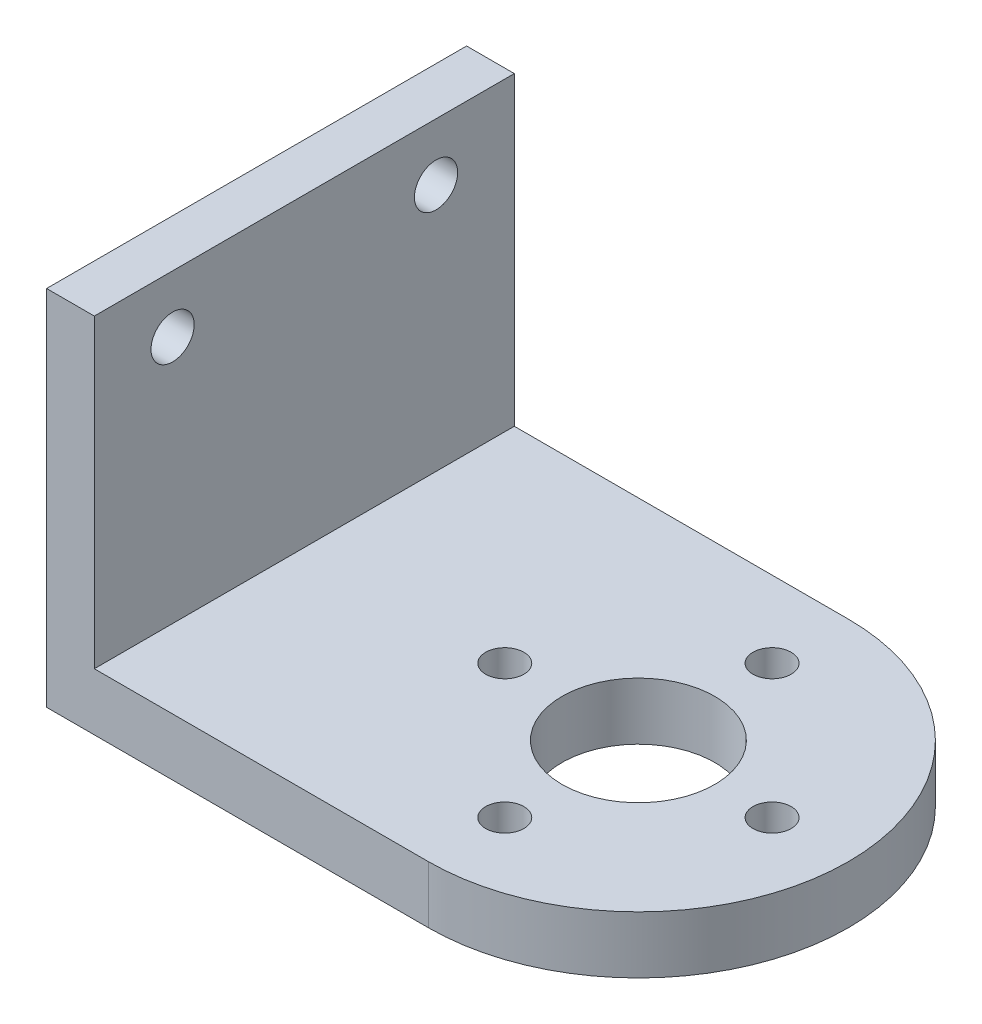
ISO-10303-21;
HEADER;
FILE_DESCRIPTION(('STEP AP214'),'2;1');
FILE_NAME('part.step','',(''),(''),'','','');
FILE_SCHEMA(('AUTOMOTIVE_DESIGN { 1 0 10303 214 1 1 1 1 }'));
ENDSEC;
DATA;
#1=APPLICATION_CONTEXT('core data for automotive mechanical design processes');
#2=APPLICATION_PROTOCOL_DEFINITION('international standard','automotive_design',2000,#1);
#3=PRODUCT_CONTEXT('',#1,'mechanical');
#4=PRODUCT('Part','Part','',(#3));
#5=PRODUCT_RELATED_PRODUCT_CATEGORY('part','',(#4));
#6=PRODUCT_DEFINITION_FORMATION('','',#4);
#7=PRODUCT_DEFINITION_CONTEXT('part definition',#1,'design');
#8=PRODUCT_DEFINITION('design','',#6,#7);
#9=PRODUCT_DEFINITION_SHAPE('','',#8);
#10=(LENGTH_UNIT() NAMED_UNIT(*) SI_UNIT(.MILLI.,.METRE.));
#11=(NAMED_UNIT(*) PLANE_ANGLE_UNIT() SI_UNIT($,.RADIAN.));
#12=(NAMED_UNIT(*) SI_UNIT($,.STERADIAN.) SOLID_ANGLE_UNIT());
#13=UNCERTAINTY_MEASURE_WITH_UNIT(LENGTH_MEASURE(1.E-05),#10,'distance_accuracy_value','');
#14=(GEOMETRIC_REPRESENTATION_CONTEXT(3) GLOBAL_UNCERTAINTY_ASSIGNED_CONTEXT((#13)) GLOBAL_UNIT_ASSIGNED_CONTEXT((#10,
#11,#12)) REPRESENTATION_CONTEXT('',''));
#15=CARTESIAN_POINT('',(0.,0.,0.));
#16=DIRECTION('',(0.,0.,1.));
#17=DIRECTION('',(1.,0.,0.));
#18=AXIS2_PLACEMENT_3D('',#15,#16,#17);
#19=CARTESIAN_POINT('',(6.,3.,0.));
#20=DIRECTION('',(0.,1.,0.));
#21=DIRECTION('',(0.,0.,1.));
#22=AXIS2_PLACEMENT_3D('',#19,#20,#21);
#23=PLANE('',#22);
#24=DIRECTION('',(0.,0.,-1.));
#25=VECTOR('',#24,1.);
#26=CARTESIAN_POINT('',(-11.5,3.,-11.));
#27=LINE('',#26,#25);
#28=CARTESIAN_POINT('',(-11.5,3.,11.));
#29=VERTEX_POINT('',#28);
#30=CARTESIAN_POINT('',(-11.5,3.,-11.));
#31=VERTEX_POINT('',#30);
#32=EDGE_CURVE('E50',#29,#31,#27,.T.);
#33=ORIENTED_EDGE('',*,*,#32,.F.);
#34=DIRECTION('',(1.,0.,0.));
#35=VECTOR('',#34,1.);
#36=CARTESIAN_POINT('',(6.,3.,11.));
#37=LINE('',#36,#35);
#38=CARTESIAN_POINT('',(6.,3.,11.));
#39=VERTEX_POINT('',#38);
#40=EDGE_CURVE('E88',#29,#39,#37,.T.);
#41=ORIENTED_EDGE('',*,*,#40,.T.);
#42=CARTESIAN_POINT('',(6.,3.,0.));
#43=DIRECTION('',(0.,1.,0.));
#44=DIRECTION('',(0.,0.,1.));
#45=AXIS2_PLACEMENT_3D('',#42,#43,#44);
#46=CIRCLE('',#45,11.);
#47=CARTESIAN_POINT('',(6.,3.,-11.));
#48=VERTEX_POINT('',#47);
#49=EDGE_CURVE('E56',#39,#48,#46,.T.);
#50=ORIENTED_EDGE('',*,*,#49,.T.);
#51=DIRECTION('',(-1.,0.,0.));
#52=VECTOR('',#51,1.);
#53=CARTESIAN_POINT('',(-14.,3.,-11.));
#54=LINE('',#53,#52);
#55=EDGE_CURVE('E99',#48,#31,#54,.T.);
#56=ORIENTED_EDGE('',*,*,#55,.T.);
#57=EDGE_LOOP('',(#33,#41,#50,#56));
#58=FACE_BOUND('',#57,.T.);
#59=CARTESIAN_POINT('',(-1.,3.,0.));
#60=DIRECTION('',(0.,1.,0.));
#61=DIRECTION('',(0.,0.,1.));
#62=AXIS2_PLACEMENT_3D('',#59,#60,#61);
#63=CIRCLE('',#62,1.);
#64=CARTESIAN_POINT('',(-1.,3.,0.999999999999951));
#65=VERTEX_POINT('',#64);
#66=EDGE_CURVE('E145',#65,#65,#63,.T.);
#67=ORIENTED_EDGE('',*,*,#66,.F.);
#68=EDGE_LOOP('',(#67));
#69=FACE_BOUND('',#68,.T.);
#70=CARTESIAN_POINT('',(6.,3.,0.));
#71=DIRECTION('',(0.,1.,0.));
#72=DIRECTION('',(0.,0.,1.));
#73=AXIS2_PLACEMENT_3D('',#70,#71,#72);
#74=CIRCLE('',#73,4.);
#75=CARTESIAN_POINT('',(6.,3.,4.));
#76=VERTEX_POINT('',#75);
#77=EDGE_CURVE('E157',#76,#76,#74,.T.);
#78=ORIENTED_EDGE('',*,*,#77,.F.);
#79=EDGE_LOOP('',(#78));
#80=FACE_BOUND('',#79,.T.);
#81=CARTESIAN_POINT('',(13.,3.,0.));
#82=DIRECTION('',(0.,1.,0.));
#83=DIRECTION('',(0.,0.,1.));
#84=AXIS2_PLACEMENT_3D('',#81,#82,#83);
#85=CIRCLE('',#84,1.);
#86=CARTESIAN_POINT('',(13.,3.,1.));
#87=VERTEX_POINT('',#86);
#88=EDGE_CURVE('E104',#87,#87,#85,.T.);
#89=ORIENTED_EDGE('',*,*,#88,.F.);
#90=EDGE_LOOP('',(#89));
#91=FACE_BOUND('',#90,.T.);
#92=CARTESIAN_POINT('',(5.99999999999998,3.,7.));
#93=DIRECTION('',(0.,1.,0.));
#94=DIRECTION('',(0.,0.,1.));
#95=AXIS2_PLACEMENT_3D('',#92,#93,#94);
#96=CIRCLE('',#95,1.);
#97=CARTESIAN_POINT('',(5.99999999999998,3.,8.));
#98=VERTEX_POINT('',#97);
#99=EDGE_CURVE('E151',#98,#98,#96,.T.);
#100=ORIENTED_EDGE('',*,*,#99,.F.);
#101=EDGE_LOOP('',(#100));
#102=FACE_BOUND('',#101,.T.);
#103=CARTESIAN_POINT('',(6.00000000000008,3.,-7.));
#104=DIRECTION('',(0.,1.,0.));
#105=DIRECTION('',(0.,0.,1.));
#106=AXIS2_PLACEMENT_3D('',#103,#104,#105);
#107=CIRCLE('',#106,1.);
#108=CARTESIAN_POINT('',(6.00000000000008,3.,-6.));
#109=VERTEX_POINT('',#108);
#110=EDGE_CURVE('E136',#109,#109,#107,.T.);
#111=ORIENTED_EDGE('',*,*,#110,.F.);
#112=EDGE_LOOP('',(#111));
#113=FACE_BOUND('',#112,.T.);
#114=ADVANCED_FACE('F35',(#58,#69,#80,#91,#102,#113),#23,.T.);
#115=CARTESIAN_POINT('',(6.,0.,0.));
#116=DIRECTION('',(0.,1.,0.));
#117=DIRECTION('',(0.,0.,1.));
#118=AXIS2_PLACEMENT_3D('',#115,#116,#117);
#119=PLANE('',#118);
#120=DIRECTION('',(1.,0.,0.));
#121=VECTOR('',#120,1.);
#122=CARTESIAN_POINT('',(6.,0.,11.));
#123=LINE('',#122,#121);
#124=CARTESIAN_POINT('',(-14.,0.,11.));
#125=VERTEX_POINT('',#124);
#126=CARTESIAN_POINT('',(6.,0.,11.));
#127=VERTEX_POINT('',#126);
#128=EDGE_CURVE('E94',#125,#127,#123,.T.);
#129=ORIENTED_EDGE('',*,*,#128,.F.);
#130=DIRECTION('',(0.,0.,1.));
#131=VECTOR('',#130,1.);
#132=CARTESIAN_POINT('',(-14.,0.,11.));
#133=LINE('',#132,#131);
#134=CARTESIAN_POINT('',(-14.,0.,-11.));
#135=VERTEX_POINT('',#134);
#136=EDGE_CURVE('E76',#135,#125,#133,.T.);
#137=ORIENTED_EDGE('',*,*,#136,.F.);
#138=DIRECTION('',(-1.,0.,0.));
#139=VECTOR('',#138,1.);
#140=CARTESIAN_POINT('',(-14.,0.,-11.));
#141=LINE('',#140,#139);
#142=CARTESIAN_POINT('',(6.,0.,-11.));
#143=VERTEX_POINT('',#142);
#144=EDGE_CURVE('E89',#143,#135,#141,.T.);
#145=ORIENTED_EDGE('',*,*,#144,.F.);
#146=CARTESIAN_POINT('',(6.,0.,0.));
#147=DIRECTION('',(0.,1.,0.));
#148=DIRECTION('',(0.,0.,1.));
#149=AXIS2_PLACEMENT_3D('',#146,#147,#148);
#150=CIRCLE('',#149,11.);
#151=EDGE_CURVE('E103',#127,#143,#150,.T.);
#152=ORIENTED_EDGE('',*,*,#151,.F.);
#153=EDGE_LOOP('',(#129,#137,#145,#152));
#154=FACE_BOUND('',#153,.T.);
#155=CARTESIAN_POINT('',(13.,0.,0.));
#156=DIRECTION('',(0.,1.,0.));
#157=DIRECTION('',(0.,0.,1.));
#158=AXIS2_PLACEMENT_3D('',#155,#156,#157);
#159=CIRCLE('',#158,1.);
#160=CARTESIAN_POINT('',(13.,0.,1.));
#161=VERTEX_POINT('',#160);
#162=EDGE_CURVE('E108',#161,#161,#159,.T.);
#163=ORIENTED_EDGE('',*,*,#162,.T.);
#164=EDGE_LOOP('',(#163));
#165=FACE_BOUND('',#164,.T.);
#166=CARTESIAN_POINT('',(6.,0.,0.));
#167=DIRECTION('',(0.,1.,0.));
#168=DIRECTION('',(0.,0.,1.));
#169=AXIS2_PLACEMENT_3D('',#166,#167,#168);
#170=CIRCLE('',#169,4.);
#171=CARTESIAN_POINT('',(6.,0.,4.));
#172=VERTEX_POINT('',#171);
#173=EDGE_CURVE('E154',#172,#172,#170,.T.);
#174=ORIENTED_EDGE('',*,*,#173,.T.);
#175=EDGE_LOOP('',(#174));
#176=FACE_BOUND('',#175,.T.);
#177=CARTESIAN_POINT('',(5.99999999999998,0.,7.));
#178=DIRECTION('',(0.,1.,0.));
#179=DIRECTION('',(0.,0.,1.));
#180=AXIS2_PLACEMENT_3D('',#177,#178,#179);
#181=CIRCLE('',#180,1.);
#182=CARTESIAN_POINT('',(5.99999999999998,0.,8.));
#183=VERTEX_POINT('',#182);
#184=EDGE_CURVE('E148',#183,#183,#181,.T.);
#185=ORIENTED_EDGE('',*,*,#184,.T.);
#186=EDGE_LOOP('',(#185));
#187=FACE_BOUND('',#186,.T.);
#188=CARTESIAN_POINT('',(-1.,0.,0.));
#189=DIRECTION('',(0.,1.,0.));
#190=DIRECTION('',(0.,0.,1.));
#191=AXIS2_PLACEMENT_3D('',#188,#189,#190);
#192=CIRCLE('',#191,1.);
#193=CARTESIAN_POINT('',(-1.,0.,0.999999999999951));
#194=VERTEX_POINT('',#193);
#195=EDGE_CURVE('E143',#194,#194,#192,.T.);
#196=ORIENTED_EDGE('',*,*,#195,.T.);
#197=EDGE_LOOP('',(#196));
#198=FACE_BOUND('',#197,.T.);
#199=CARTESIAN_POINT('',(6.00000000000008,0.,-7.));
#200=DIRECTION('',(0.,1.,0.));
#201=DIRECTION('',(0.,0.,1.));
#202=AXIS2_PLACEMENT_3D('',#199,#200,#201);
#203=CIRCLE('',#202,1.);
#204=CARTESIAN_POINT('',(6.00000000000008,0.,-6.));
#205=VERTEX_POINT('',#204);
#206=EDGE_CURVE('E132',#205,#205,#203,.T.);
#207=ORIENTED_EDGE('',*,*,#206,.T.);
#208=EDGE_LOOP('',(#207));
#209=FACE_BOUND('',#208,.T.);
#210=ADVANCED_FACE('F101',(#154,#165,#176,#187,#198,#209),#119,.F.);
#211=CARTESIAN_POINT('',(6.,3.,11.));
#212=DIRECTION('',(0.,0.,-1.));
#213=DIRECTION('',(-1.,0.,0.));
#214=AXIS2_PLACEMENT_3D('',#211,#212,#213);
#215=PLANE('',#214);
#216=ORIENTED_EDGE('',*,*,#128,.T.);
#217=DIRECTION('',(0.,-1.,0.));
#218=VECTOR('',#217,1.);
#219=CARTESIAN_POINT('',(6.,3.,11.));
#220=LINE('',#219,#218);
#221=EDGE_CURVE('E11',#39,#127,#220,.T.);
#222=ORIENTED_EDGE('',*,*,#221,.F.);
#223=ORIENTED_EDGE('',*,*,#40,.F.);
#224=DIRECTION('',(0.,-1.,0.));
#225=VECTOR('',#224,1.);
#226=CARTESIAN_POINT('',(-11.5,19.,11.));
#227=LINE('',#226,#225);
#228=CARTESIAN_POINT('',(-11.5,19.,11.));
#229=VERTEX_POINT('',#228);
#230=EDGE_CURVE('E123',#229,#29,#227,.T.);
#231=ORIENTED_EDGE('',*,*,#230,.F.);
#232=DIRECTION('',(1.,0.,0.));
#233=VECTOR('',#232,1.);
#234=CARTESIAN_POINT('',(-11.5,19.,11.));
#235=LINE('',#234,#233);
#236=CARTESIAN_POINT('',(-14.,19.,11.));
#237=VERTEX_POINT('',#236);
#238=EDGE_CURVE('E97',#237,#229,#235,.T.);
#239=ORIENTED_EDGE('',*,*,#238,.F.);
#240=DIRECTION('',(0.,-1.,0.));
#241=VECTOR('',#240,1.);
#242=CARTESIAN_POINT('',(-14.,3.,11.));
#243=LINE('',#242,#241);
#244=EDGE_CURVE('E81',#237,#125,#243,.T.);
#245=ORIENTED_EDGE('',*,*,#244,.T.);
#246=EDGE_LOOP('',(#216,#222,#223,#231,#239,#245));
#247=FACE_BOUND('',#246,.T.);
#248=ADVANCED_FACE('F37',(#247),#215,.F.);
#249=CARTESIAN_POINT('',(6.,3.,0.));
#250=DIRECTION('',(0.,-1.,0.));
#251=DIRECTION('',(0.,0.,-1.));
#252=AXIS2_PLACEMENT_3D('',#249,#250,#251);
#253=CYLINDRICAL_SURFACE('',#252,11.);
#254=ORIENTED_EDGE('',*,*,#151,.T.);
#255=DIRECTION('',(0.,-1.,0.));
#256=VECTOR('',#255,1.);
#257=CARTESIAN_POINT('',(6.,3.,-11.));
#258=LINE('',#257,#256);
#259=EDGE_CURVE('E43',#48,#143,#258,.T.);
#260=ORIENTED_EDGE('',*,*,#259,.F.);
#261=ORIENTED_EDGE('',*,*,#49,.F.);
#262=ORIENTED_EDGE('',*,*,#221,.T.);
#263=EDGE_LOOP('',(#254,#260,#261,#262));
#264=FACE_BOUND('',#263,.T.);
#265=ADVANCED_FACE('F120',(#264),#253,.T.);
#266=CARTESIAN_POINT('',(-14.,3.,-11.));
#267=DIRECTION('',(0.,0.,1.));
#268=DIRECTION('',(1.,0.,0.));
#269=AXIS2_PLACEMENT_3D('',#266,#267,#268);
#270=PLANE('',#269);
#271=ORIENTED_EDGE('',*,*,#144,.T.);
#272=DIRECTION('',(0.,-1.,0.));
#273=VECTOR('',#272,1.);
#274=CARTESIAN_POINT('',(-14.,3.,-11.));
#275=LINE('',#274,#273);
#276=CARTESIAN_POINT('',(-14.,19.,-11.));
#277=VERTEX_POINT('',#276);
#278=EDGE_CURVE('E84',#277,#135,#275,.T.);
#279=ORIENTED_EDGE('',*,*,#278,.F.);
#280=DIRECTION('',(-1.,0.,0.));
#281=VECTOR('',#280,1.);
#282=CARTESIAN_POINT('',(-14.,19.,-11.));
#283=LINE('',#282,#281);
#284=CARTESIAN_POINT('',(-11.5,19.,-11.));
#285=VERTEX_POINT('',#284);
#286=EDGE_CURVE('E138',#285,#277,#283,.T.);
#287=ORIENTED_EDGE('',*,*,#286,.F.);
#288=DIRECTION('',(0.,-1.,0.));
#289=VECTOR('',#288,1.);
#290=CARTESIAN_POINT('',(-11.5,19.,-11.));
#291=LINE('',#290,#289);
#292=EDGE_CURVE('E133',#285,#31,#291,.T.);
#293=ORIENTED_EDGE('',*,*,#292,.T.);
#294=ORIENTED_EDGE('',*,*,#55,.F.);
#295=ORIENTED_EDGE('',*,*,#259,.T.);
#296=EDGE_LOOP('',(#271,#279,#287,#293,#294,#295));
#297=FACE_BOUND('',#296,.T.);
#298=ADVANCED_FACE('F117',(#297),#270,.F.);
#299=CARTESIAN_POINT('',(-14.,3.,11.));
#300=DIRECTION('',(1.,0.,0.));
#301=DIRECTION('',(0.,0.,-1.));
#302=AXIS2_PLACEMENT_3D('',#299,#300,#301);
#303=PLANE('',#302);
#304=CARTESIAN_POINT('',(-14.,16.,6.9));
#305=DIRECTION('',(1.,0.,0.));
#306=DIRECTION('',(0.,0.,-1.));
#307=AXIS2_PLACEMENT_3D('',#304,#305,#306);
#308=CIRCLE('',#307,1.13097743795664);
#309=CARTESIAN_POINT('',(-14.,16.,5.76902256204336));
#310=VERTEX_POINT('',#309);
#311=EDGE_CURVE('E184',#310,#310,#308,.T.);
#312=ORIENTED_EDGE('',*,*,#311,.T.);
#313=EDGE_LOOP('',(#312));
#314=FACE_BOUND('',#313,.T.);
#315=CARTESIAN_POINT('',(-14.,16.,-6.9));
#316=DIRECTION('',(1.,0.,0.));
#317=DIRECTION('',(0.,0.,-1.));
#318=AXIS2_PLACEMENT_3D('',#315,#316,#317);
#319=CIRCLE('',#318,1.1323934249751);
#320=CARTESIAN_POINT('',(-14.,16.,-8.0323934249751));
#321=VERTEX_POINT('',#320);
#322=EDGE_CURVE('E178',#321,#321,#319,.T.);
#323=ORIENTED_EDGE('',*,*,#322,.T.);
#324=EDGE_LOOP('',(#323));
#325=FACE_BOUND('',#324,.T.);
#326=ORIENTED_EDGE('',*,*,#136,.T.);
#327=ORIENTED_EDGE('',*,*,#244,.F.);
#328=DIRECTION('',(0.,0.,1.));
#329=VECTOR('',#328,1.);
#330=CARTESIAN_POINT('',(-14.,19.,-11.));
#331=LINE('',#330,#329);
#332=EDGE_CURVE('E172',#277,#237,#331,.T.);
#333=ORIENTED_EDGE('',*,*,#332,.F.);
#334=ORIENTED_EDGE('',*,*,#278,.T.);
#335=EDGE_LOOP('',(#326,#327,#333,#334));
#336=FACE_BOUND('',#335,.T.);
#337=ADVANCED_FACE('F78',(#314,#325,#336),#303,.F.);
#338=CARTESIAN_POINT('',(13.,3.,0.));
#339=DIRECTION('',(0.,-1.,0.));
#340=DIRECTION('',(0.,0.,-1.));
#341=AXIS2_PLACEMENT_3D('',#338,#339,#340);
#342=CYLINDRICAL_SURFACE('',#341,1.);
#343=ORIENTED_EDGE('',*,*,#88,.T.);
#344=EDGE_LOOP('',(#343));
#345=FACE_BOUND('',#344,.T.);
#346=ORIENTED_EDGE('',*,*,#162,.F.);
#347=EDGE_LOOP('',(#346));
#348=FACE_BOUND('',#347,.T.);
#349=ADVANCED_FACE('F219',(#345,#348),#342,.F.);
#350=CARTESIAN_POINT('',(6.,3.,0.));
#351=DIRECTION('',(0.,-1.,0.));
#352=DIRECTION('',(0.,0.,-1.));
#353=AXIS2_PLACEMENT_3D('',#350,#351,#352);
#354=CYLINDRICAL_SURFACE('',#353,4.);
#355=ORIENTED_EDGE('',*,*,#77,.T.);
#356=EDGE_LOOP('',(#355));
#357=FACE_BOUND('',#356,.T.);
#358=ORIENTED_EDGE('',*,*,#173,.F.);
#359=EDGE_LOOP('',(#358));
#360=FACE_BOUND('',#359,.T.);
#361=ADVANCED_FACE('F253',(#357,#360),#354,.F.);
#362=CARTESIAN_POINT('',(5.99999999999998,3.,7.));
#363=DIRECTION('',(0.,-1.,0.));
#364=DIRECTION('',(0.,0.,-1.));
#365=AXIS2_PLACEMENT_3D('',#362,#363,#364);
#366=CYLINDRICAL_SURFACE('',#365,1.);
#367=ORIENTED_EDGE('',*,*,#99,.T.);
#368=EDGE_LOOP('',(#367));
#369=FACE_BOUND('',#368,.T.);
#370=ORIENTED_EDGE('',*,*,#184,.F.);
#371=EDGE_LOOP('',(#370));
#372=FACE_BOUND('',#371,.T.);
#373=ADVANCED_FACE('F263',(#369,#372),#366,.F.);
#374=CARTESIAN_POINT('',(-1.,3.,0.));
#375=DIRECTION('',(0.,-1.,0.));
#376=DIRECTION('',(0.,0.,-1.));
#377=AXIS2_PLACEMENT_3D('',#374,#375,#376);
#378=CYLINDRICAL_SURFACE('',#377,1.);
#379=ORIENTED_EDGE('',*,*,#66,.T.);
#380=EDGE_LOOP('',(#379));
#381=FACE_BOUND('',#380,.T.);
#382=ORIENTED_EDGE('',*,*,#195,.F.);
#383=EDGE_LOOP('',(#382));
#384=FACE_BOUND('',#383,.T.);
#385=ADVANCED_FACE('F272',(#381,#384),#378,.F.);
#386=CARTESIAN_POINT('',(6.00000000000008,3.,-7.));
#387=DIRECTION('',(0.,-1.,0.));
#388=DIRECTION('',(0.,0.,-1.));
#389=AXIS2_PLACEMENT_3D('',#386,#387,#388);
#390=CYLINDRICAL_SURFACE('',#389,1.);
#391=ORIENTED_EDGE('',*,*,#110,.T.);
#392=EDGE_LOOP('',(#391));
#393=FACE_BOUND('',#392,.T.);
#394=ORIENTED_EDGE('',*,*,#206,.F.);
#395=EDGE_LOOP('',(#394));
#396=FACE_BOUND('',#395,.T.);
#397=ADVANCED_FACE('F198',(#393,#396),#390,.F.);
#398=CARTESIAN_POINT('',(-11.5,19.,-11.));
#399=DIRECTION('',(-1.,0.,0.));
#400=DIRECTION('',(0.,0.,1.));
#401=AXIS2_PLACEMENT_3D('',#398,#399,#400);
#402=PLANE('',#401);
#403=CARTESIAN_POINT('',(-11.5,16.,6.9));
#404=DIRECTION('',(1.,0.,0.));
#405=DIRECTION('',(0.,0.,-1.));
#406=AXIS2_PLACEMENT_3D('',#403,#404,#405);
#407=CIRCLE('',#406,1.13097743795664);
#408=CARTESIAN_POINT('',(-11.5,16.,5.76902256204336));
#409=VERTEX_POINT('',#408);
#410=EDGE_CURVE('E189',#409,#409,#407,.T.);
#411=ORIENTED_EDGE('',*,*,#410,.F.);
#412=EDGE_LOOP('',(#411));
#413=FACE_BOUND('',#412,.T.);
#414=CARTESIAN_POINT('',(-11.5,16.,-6.9));
#415=DIRECTION('',(1.,0.,0.));
#416=DIRECTION('',(0.,0.,-1.));
#417=AXIS2_PLACEMENT_3D('',#414,#415,#416);
#418=CIRCLE('',#417,1.1323934249751);
#419=CARTESIAN_POINT('',(-11.5,16.,-8.0323934249751));
#420=VERTEX_POINT('',#419);
#421=EDGE_CURVE('E180',#420,#420,#418,.T.);
#422=ORIENTED_EDGE('',*,*,#421,.F.);
#423=EDGE_LOOP('',(#422));
#424=FACE_BOUND('',#423,.T.);
#425=ORIENTED_EDGE('',*,*,#32,.T.);
#426=ORIENTED_EDGE('',*,*,#292,.F.);
#427=DIRECTION('',(0.,0.,-1.));
#428=VECTOR('',#427,1.);
#429=CARTESIAN_POINT('',(-11.5,19.,-11.));
#430=LINE('',#429,#428);
#431=EDGE_CURVE('E131',#229,#285,#430,.T.);
#432=ORIENTED_EDGE('',*,*,#431,.F.);
#433=ORIENTED_EDGE('',*,*,#230,.T.);
#434=EDGE_LOOP('',(#425,#426,#432,#433));
#435=FACE_BOUND('',#434,.T.);
#436=ADVANCED_FACE('F127',(#413,#424,#435),#402,.F.);
#437=CARTESIAN_POINT('',(0.,19.,0.));
#438=DIRECTION('',(0.,-1.,0.));
#439=DIRECTION('',(0.,0.,-1.));
#440=AXIS2_PLACEMENT_3D('',#437,#438,#439);
#441=PLANE('',#440);
#442=ORIENTED_EDGE('',*,*,#332,.T.);
#443=ORIENTED_EDGE('',*,*,#238,.T.);
#444=ORIENTED_EDGE('',*,*,#431,.T.);
#445=ORIENTED_EDGE('',*,*,#286,.T.);
#446=EDGE_LOOP('',(#442,#443,#444,#445));
#447=FACE_BOUND('',#446,.T.);
#448=ADVANCED_FACE('F170',(#447),#441,.F.);
#449=CARTESIAN_POINT('',(-17.5,16.,-6.9));
#450=DIRECTION('',(1.,0.,0.));
#451=DIRECTION('',(0.,0.,-1.));
#452=AXIS2_PLACEMENT_3D('',#449,#450,#451);
#453=CYLINDRICAL_SURFACE('',#452,1.1323934249751);
#454=ORIENTED_EDGE('',*,*,#421,.T.);
#455=EDGE_LOOP('',(#454));
#456=FACE_BOUND('',#455,.T.);
#457=ORIENTED_EDGE('',*,*,#322,.F.);
#458=EDGE_LOOP('',(#457));
#459=FACE_BOUND('',#458,.T.);
#460=ADVANCED_FACE('F202',(#456,#459),#453,.F.);
#461=CARTESIAN_POINT('',(-17.5,16.,6.9));
#462=DIRECTION('',(1.,0.,0.));
#463=DIRECTION('',(0.,0.,-1.));
#464=AXIS2_PLACEMENT_3D('',#461,#462,#463);
#465=CYLINDRICAL_SURFACE('',#464,1.13097743795664);
#466=ORIENTED_EDGE('',*,*,#410,.T.);
#467=EDGE_LOOP('',(#466));
#468=FACE_BOUND('',#467,.T.);
#469=ORIENTED_EDGE('',*,*,#311,.F.);
#470=EDGE_LOOP('',(#469));
#471=FACE_BOUND('',#470,.T.);
#472=ADVANCED_FACE('F193',(#468,#471),#465,.F.);
#473=CLOSED_SHELL('',(#114,#210,#248,#265,#298,#337,#349,#361,#373,#385,#397,#436,#448,#460,#472));
#474=MANIFOLD_SOLID_BREP('B2',#473);
#475=ADVANCED_BREP_SHAPE_REPRESENTATION('',(#18,#474),#14);
#476=SHAPE_DEFINITION_REPRESENTATION(#9,#475);
ENDSEC;
END-ISO-10303-21;
